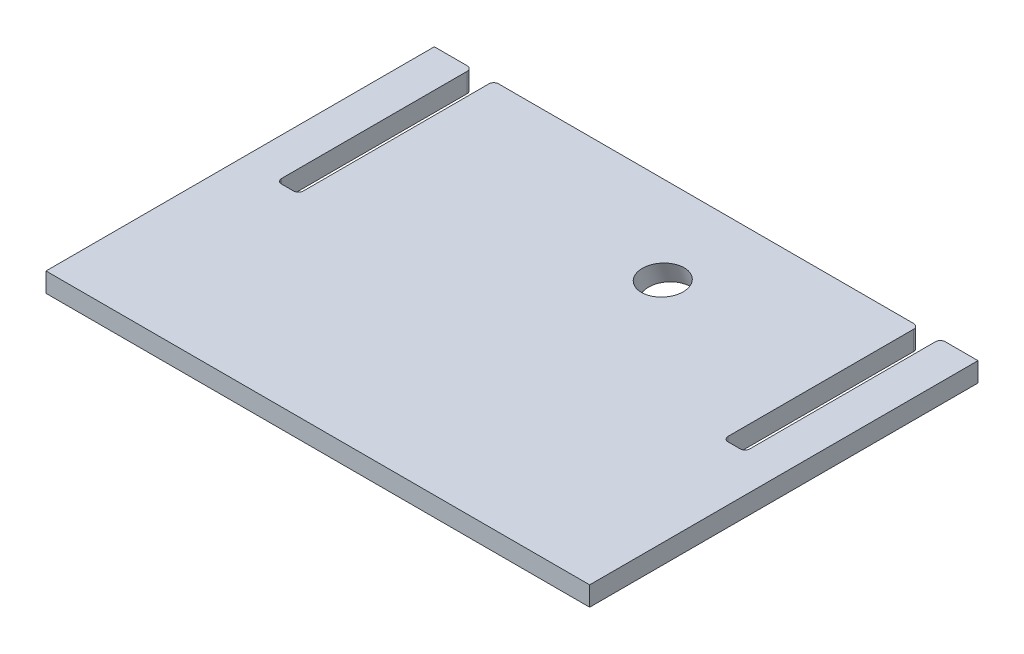
ISO-10303-21;
HEADER;
FILE_DESCRIPTION(('STEP AP214'),'2;1');
FILE_NAME('part.step','',(''),(''),'','','');
FILE_SCHEMA(('AUTOMOTIVE_DESIGN { 1 0 10303 214 1 1 1 1 }'));
ENDSEC;
DATA;
#1=APPLICATION_CONTEXT('core data for automotive mechanical design processes');
#2=APPLICATION_PROTOCOL_DEFINITION('international standard','automotive_design',2000,#1);
#3=PRODUCT_CONTEXT('',#1,'mechanical');
#4=PRODUCT('Part','Part','',(#3));
#5=PRODUCT_RELATED_PRODUCT_CATEGORY('part','',(#4));
#6=PRODUCT_DEFINITION_FORMATION('','',#4);
#7=PRODUCT_DEFINITION_CONTEXT('part definition',#1,'design');
#8=PRODUCT_DEFINITION('design','',#6,#7);
#9=PRODUCT_DEFINITION_SHAPE('','',#8);
#10=(LENGTH_UNIT() NAMED_UNIT(*) SI_UNIT(.MILLI.,.METRE.));
#11=(NAMED_UNIT(*) PLANE_ANGLE_UNIT() SI_UNIT($,.RADIAN.));
#12=(NAMED_UNIT(*) SI_UNIT($,.STERADIAN.) SOLID_ANGLE_UNIT());
#13=UNCERTAINTY_MEASURE_WITH_UNIT(LENGTH_MEASURE(1.E-05),#10,'distance_accuracy_value','');
#14=(GEOMETRIC_REPRESENTATION_CONTEXT(3) GLOBAL_UNCERTAINTY_ASSIGNED_CONTEXT((#13)) GLOBAL_UNIT_ASSIGNED_CONTEXT((#10,
#11,#12)) REPRESENTATION_CONTEXT('',''));
#15=CARTESIAN_POINT('',(0.,0.,0.));
#16=DIRECTION('',(0.,0.,1.));
#17=DIRECTION('',(1.,0.,0.));
#18=AXIS2_PLACEMENT_3D('',#15,#16,#17);
#19=CARTESIAN_POINT('',(-177.8,6.35,-127.));
#20=DIRECTION('',(0.,0.,1.));
#21=DIRECTION('',(1.,0.,0.));
#22=AXIS2_PLACEMENT_3D('',#19,#20,#21);
#23=PLANE('',#22);
#24=DIRECTION('',(-1.,0.,0.));
#25=VECTOR('',#24,1.);
#26=CARTESIAN_POINT('',(-177.8,6.35,-127.));
#27=LINE('',#26,#25);
#28=CARTESIAN_POINT('',(-156.337,6.35,-127.));
#29=VERTEX_POINT('',#28);
#30=CARTESIAN_POINT('',(-177.8,6.35,-127.));
#31=VERTEX_POINT('',#30);
#32=EDGE_CURVE('E231',#29,#31,#27,.T.);
#33=ORIENTED_EDGE('',*,*,#32,.F.);
#34=DIRECTION('',(0.,1.,0.));
#35=VECTOR('',#34,1.);
#36=CARTESIAN_POINT('',(-156.337,6.35,-127.));
#37=LINE('',#36,#35);
#38=CARTESIAN_POINT('',(-156.337,-6.35,-127.));
#39=VERTEX_POINT('',#38);
#40=EDGE_CURVE('E359',#29,#39,#37,.F.);
#41=ORIENTED_EDGE('',*,*,#40,.T.);
#42=DIRECTION('',(-1.,0.,0.));
#43=VECTOR('',#42,1.);
#44=CARTESIAN_POINT('',(-177.8,-6.35,-127.));
#45=LINE('',#44,#43);
#46=CARTESIAN_POINT('',(-177.8,-6.35,-127.));
#47=VERTEX_POINT('',#46);
#48=EDGE_CURVE('E221',#39,#47,#45,.T.);
#49=ORIENTED_EDGE('',*,*,#48,.T.);
#50=DIRECTION('',(0.,-1.,0.));
#51=VECTOR('',#50,1.);
#52=CARTESIAN_POINT('',(-177.8,6.35,-127.));
#53=LINE('',#52,#51);
#54=EDGE_CURVE('E200',#31,#47,#53,.T.);
#55=ORIENTED_EDGE('',*,*,#54,.F.);
#56=EDGE_LOOP('',(#33,#41,#49,#55));
#57=FACE_BOUND('',#56,.T.);
#58=ADVANCED_FACE('F47',(#57),#23,.F.);
#59=CARTESIAN_POINT('',(135.763,6.35,-127.));
#60=VERTEX_POINT('',#59);
#61=CARTESIAN_POINT('',(-135.763,6.35,-127.));
#62=VERTEX_POINT('',#61);
#63=EDGE_CURVE('E236',#60,#62,#27,.T.);
#64=ORIENTED_EDGE('',*,*,#63,.F.);
#65=DIRECTION('',(0.,1.,0.));
#66=VECTOR('',#65,1.);
#67=CARTESIAN_POINT('',(135.763,6.35,-127.));
#68=LINE('',#67,#66);
#69=CARTESIAN_POINT('',(135.763,-6.35,-127.));
#70=VERTEX_POINT('',#69);
#71=EDGE_CURVE('E335',#60,#70,#68,.F.);
#72=ORIENTED_EDGE('',*,*,#71,.T.);
#73=CARTESIAN_POINT('',(-135.763,-6.35,-127.));
#74=VERTEX_POINT('',#73);
#75=EDGE_CURVE('E217',#70,#74,#45,.T.);
#76=ORIENTED_EDGE('',*,*,#75,.T.);
#77=DIRECTION('',(0.,1.,0.));
#78=VECTOR('',#77,1.);
#79=CARTESIAN_POINT('',(-135.763,6.35,-127.));
#80=LINE('',#79,#78);
#81=EDGE_CURVE('E331',#74,#62,#80,.T.);
#82=ORIENTED_EDGE('',*,*,#81,.T.);
#83=EDGE_LOOP('',(#64,#72,#76,#82));
#84=FACE_BOUND('',#83,.T.);
#85=ADVANCED_FACE('F445',(#84),#23,.F.);
#86=CARTESIAN_POINT('',(177.8,6.35,-127.));
#87=DIRECTION('',(-1.,0.,0.));
#88=DIRECTION('',(0.,0.,1.));
#89=AXIS2_PLACEMENT_3D('',#86,#87,#88);
#90=PLANE('',#89);
#91=DIRECTION('',(0.,0.,-1.));
#92=VECTOR('',#91,1.);
#93=CARTESIAN_POINT('',(177.8,-6.35,-127.));
#94=LINE('',#93,#92);
#95=CARTESIAN_POINT('',(177.8,-6.35,127.));
#96=VERTEX_POINT('',#95);
#97=CARTESIAN_POINT('',(177.8,-6.35,-127.));
#98=VERTEX_POINT('',#97);
#99=EDGE_CURVE('E206',#96,#98,#94,.T.);
#100=ORIENTED_EDGE('',*,*,#99,.T.);
#101=DIRECTION('',(0.,-1.,0.));
#102=VECTOR('',#101,1.);
#103=CARTESIAN_POINT('',(177.8,6.35,-127.));
#104=LINE('',#103,#102);
#105=CARTESIAN_POINT('',(177.8,6.35,-127.));
#106=VERTEX_POINT('',#105);
#107=EDGE_CURVE('E392',#106,#98,#104,.T.);
#108=ORIENTED_EDGE('',*,*,#107,.F.);
#109=DIRECTION('',(0.,0.,-1.));
#110=VECTOR('',#109,1.);
#111=CARTESIAN_POINT('',(177.8,6.35,-127.));
#112=LINE('',#111,#110);
#113=CARTESIAN_POINT('',(177.8,6.35,127.));
#114=VERTEX_POINT('',#113);
#115=EDGE_CURVE('E208',#114,#106,#112,.T.);
#116=ORIENTED_EDGE('',*,*,#115,.F.);
#117=DIRECTION('',(0.,-1.,0.));
#118=VECTOR('',#117,1.);
#119=CARTESIAN_POINT('',(177.8,6.35,127.));
#120=LINE('',#119,#118);
#121=EDGE_CURVE('E193',#114,#96,#120,.T.);
#122=ORIENTED_EDGE('',*,*,#121,.T.);
#123=EDGE_LOOP('',(#100,#108,#116,#122));
#124=FACE_BOUND('',#123,.T.);
#125=ADVANCED_FACE('F204',(#124),#90,.F.);
#126=CARTESIAN_POINT('',(156.337,-6.35,-127.));
#127=VERTEX_POINT('',#126);
#128=EDGE_CURVE('E210',#98,#127,#45,.T.);
#129=ORIENTED_EDGE('',*,*,#128,.T.);
#130=DIRECTION('',(0.,1.,0.));
#131=VECTOR('',#130,1.);
#132=CARTESIAN_POINT('',(156.337,6.35,-127.));
#133=LINE('',#132,#131);
#134=CARTESIAN_POINT('',(156.337,6.35,-127.));
#135=VERTEX_POINT('',#134);
#136=EDGE_CURVE('E283',#127,#135,#133,.T.);
#137=ORIENTED_EDGE('',*,*,#136,.T.);
#138=EDGE_CURVE('E232',#106,#135,#27,.T.);
#139=ORIENTED_EDGE('',*,*,#138,.F.);
#140=ORIENTED_EDGE('',*,*,#107,.T.);
#141=EDGE_LOOP('',(#129,#137,#139,#140));
#142=FACE_BOUND('',#141,.T.);
#143=ADVANCED_FACE('F473',(#142),#23,.F.);
#144=CARTESIAN_POINT('',(-177.8,6.35,-127.));
#145=DIRECTION('',(1.,0.,0.));
#146=DIRECTION('',(0.,0.,-1.));
#147=AXIS2_PLACEMENT_3D('',#144,#145,#146);
#148=PLANE('',#147);
#149=DIRECTION('',(0.,0.,1.));
#150=VECTOR('',#149,1.);
#151=CARTESIAN_POINT('',(-177.8,-6.35,-127.));
#152=LINE('',#151,#150);
#153=CARTESIAN_POINT('',(-177.8,-6.35,127.));
#154=VERTEX_POINT('',#153);
#155=EDGE_CURVE('E390',#47,#154,#152,.T.);
#156=ORIENTED_EDGE('',*,*,#155,.T.);
#157=DIRECTION('',(0.,-1.,0.));
#158=VECTOR('',#157,1.);
#159=CARTESIAN_POINT('',(-177.8,6.35,127.));
#160=LINE('',#159,#158);
#161=CARTESIAN_POINT('',(-177.8,6.35,127.));
#162=VERTEX_POINT('',#161);
#163=EDGE_CURVE('E196',#162,#154,#160,.T.);
#164=ORIENTED_EDGE('',*,*,#163,.F.);
#165=DIRECTION('',(0.,0.,1.));
#166=VECTOR('',#165,1.);
#167=CARTESIAN_POINT('',(-177.8,6.35,-127.));
#168=LINE('',#167,#166);
#169=EDGE_CURVE('E228',#31,#162,#168,.T.);
#170=ORIENTED_EDGE('',*,*,#169,.F.);
#171=ORIENTED_EDGE('',*,*,#54,.T.);
#172=EDGE_LOOP('',(#156,#164,#170,#171));
#173=FACE_BOUND('',#172,.T.);
#174=ADVANCED_FACE('F408',(#173),#148,.F.);
#175=CARTESIAN_POINT('',(-177.8,6.35,127.));
#176=DIRECTION('',(0.,0.,-1.));
#177=DIRECTION('',(-1.,0.,0.));
#178=AXIS2_PLACEMENT_3D('',#175,#176,#177);
#179=PLANE('',#178);
#180=DIRECTION('',(1.,0.,0.));
#181=VECTOR('',#180,1.);
#182=CARTESIAN_POINT('',(-177.8,-6.35,127.));
#183=LINE('',#182,#181);
#184=EDGE_CURVE('E189',#154,#96,#183,.T.);
#185=ORIENTED_EDGE('',*,*,#184,.T.);
#186=ORIENTED_EDGE('',*,*,#121,.F.);
#187=DIRECTION('',(1.,0.,0.));
#188=VECTOR('',#187,1.);
#189=CARTESIAN_POINT('',(-177.8,6.35,127.));
#190=LINE('',#189,#188);
#191=EDGE_CURVE('E225',#162,#114,#190,.T.);
#192=ORIENTED_EDGE('',*,*,#191,.F.);
#193=ORIENTED_EDGE('',*,*,#163,.T.);
#194=EDGE_LOOP('',(#185,#186,#192,#193));
#195=FACE_BOUND('',#194,.T.);
#196=ADVANCED_FACE('F191',(#195),#179,.F.);
#197=CARTESIAN_POINT('',(0.,6.35,0.));
#198=DIRECTION('',(0.,1.,0.));
#199=DIRECTION('',(0.,0.,1.));
#200=AXIS2_PLACEMENT_3D('',#197,#198,#199);
#201=PLANE('',#200);
#202=CARTESIAN_POINT('',(29.06326332179,6.35,-69.5494140717771));
#203=DIRECTION('',(0.,1.,0.));
#204=DIRECTION('',(0.,0.,1.));
#205=AXIS2_PLACEMENT_3D('',#202,#203,#204);
#206=ELLIPSE('',#205,13.9966885153252,13.335);
#207=CARTESIAN_POINT('',(29.0632633217901,6.35,-55.5527255564518));
#208=VERTEX_POINT('',#207);
#209=EDGE_CURVE('E380',#208,#208,#206,.F.);
#210=ORIENTED_EDGE('',*,*,#209,.T.);
#211=EDGE_LOOP('',(#210));
#212=FACE_BOUND('',#211,.T.);
#213=ORIENTED_EDGE('',*,*,#138,.T.);
#214=CARTESIAN_POINT('',(156.337,6.35,-123.825));
#215=DIRECTION('',(0.,1.,0.));
#216=DIRECTION('',(0.,0.,1.));
#217=AXIS2_PLACEMENT_3D('',#214,#215,#216);
#218=CIRCLE('',#217,3.175);
#219=CARTESIAN_POINT('',(153.162,6.35,-123.825));
#220=VERTEX_POINT('',#219);
#221=EDGE_CURVE('E296',#135,#220,#218,.T.);
#222=ORIENTED_EDGE('',*,*,#221,.T.);
#223=DIRECTION('',(0.,0.,-1.));
#224=VECTOR('',#223,1.);
#225=CARTESIAN_POINT('',(153.162,6.35,0.));
#226=LINE('',#225,#224);
#227=CARTESIAN_POINT('',(153.162,6.35,-2.413));
#228=VERTEX_POINT('',#227);
#229=EDGE_CURVE('E267',#228,#220,#226,.T.);
#230=ORIENTED_EDGE('',*,*,#229,.F.);
#231=CARTESIAN_POINT('',(149.987,6.35,-2.413));
#232=DIRECTION('',(0.,1.,0.));
#233=DIRECTION('',(0.,0.,1.));
#234=AXIS2_PLACEMENT_3D('',#231,#232,#233);
#235=CIRCLE('',#234,3.175);
#236=CARTESIAN_POINT('',(149.987,6.35,0.762));
#237=VERTEX_POINT('',#236);
#238=EDGE_CURVE('E362',#228,#237,#235,.F.);
#239=ORIENTED_EDGE('',*,*,#238,.T.);
#240=DIRECTION('',(1.,0.,0.));
#241=VECTOR('',#240,1.);
#242=CARTESIAN_POINT('',(0.,6.35,0.762));
#243=LINE('',#242,#241);
#244=CARTESIAN_POINT('',(142.113,6.35,0.762));
#245=VERTEX_POINT('',#244);
#246=EDGE_CURVE('E244',#245,#237,#243,.T.);
#247=ORIENTED_EDGE('',*,*,#246,.F.);
#248=CARTESIAN_POINT('',(142.113,6.35,-2.413));
#249=DIRECTION('',(0.,1.,0.));
#250=DIRECTION('',(0.,0.,1.));
#251=AXIS2_PLACEMENT_3D('',#248,#249,#250);
#252=CIRCLE('',#251,3.175);
#253=CARTESIAN_POINT('',(138.938,6.35,-2.413));
#254=VERTEX_POINT('',#253);
#255=EDGE_CURVE('E368',#245,#254,#252,.F.);
#256=ORIENTED_EDGE('',*,*,#255,.T.);
#257=DIRECTION('',(0.,0.,1.));
#258=VECTOR('',#257,1.);
#259=CARTESIAN_POINT('',(138.938,6.35,0.));
#260=LINE('',#259,#258);
#261=CARTESIAN_POINT('',(138.938,6.35,-123.825));
#262=VERTEX_POINT('',#261);
#263=EDGE_CURVE('E268',#262,#254,#260,.T.);
#264=ORIENTED_EDGE('',*,*,#263,.F.);
#265=CARTESIAN_POINT('',(135.763,6.35,-123.825));
#266=DIRECTION('',(0.,1.,0.));
#267=DIRECTION('',(0.,0.,1.));
#268=AXIS2_PLACEMENT_3D('',#265,#266,#267);
#269=CIRCLE('',#268,3.175);
#270=EDGE_CURVE('E293',#262,#60,#269,.T.);
#271=ORIENTED_EDGE('',*,*,#270,.T.);
#272=ORIENTED_EDGE('',*,*,#63,.T.);
#273=CARTESIAN_POINT('',(-135.763,6.35,-123.825));
#274=DIRECTION('',(0.,1.,0.));
#275=DIRECTION('',(0.,0.,1.));
#276=AXIS2_PLACEMENT_3D('',#273,#274,#275);
#277=CIRCLE('',#276,3.175);
#278=CARTESIAN_POINT('',(-138.938,6.35,-123.825));
#279=VERTEX_POINT('',#278);
#280=EDGE_CURVE('E290',#62,#279,#277,.T.);
#281=ORIENTED_EDGE('',*,*,#280,.T.);
#282=DIRECTION('',(0.,0.,-1.));
#283=VECTOR('',#282,1.);
#284=CARTESIAN_POINT('',(-138.938,6.35,0.));
#285=LINE('',#284,#283);
#286=CARTESIAN_POINT('',(-138.938,6.35,-2.41300000000005));
#287=VERTEX_POINT('',#286);
#288=EDGE_CURVE('E243',#287,#279,#285,.T.);
#289=ORIENTED_EDGE('',*,*,#288,.F.);
#290=CARTESIAN_POINT('',(-142.113,6.35,-2.41300000000005));
#291=DIRECTION('',(0.,1.,0.));
#292=DIRECTION('',(0.,0.,1.));
#293=AXIS2_PLACEMENT_3D('',#290,#291,#292);
#294=CIRCLE('',#293,3.175);
#295=CARTESIAN_POINT('',(-142.113,6.35,0.761999999999944));
#296=VERTEX_POINT('',#295);
#297=EDGE_CURVE('E373',#287,#296,#294,.F.);
#298=ORIENTED_EDGE('',*,*,#297,.T.);
#299=DIRECTION('',(1.,0.,0.));
#300=VECTOR('',#299,1.);
#301=CARTESIAN_POINT('',(0.,6.35,0.761999999999944));
#302=LINE('',#301,#300);
#303=CARTESIAN_POINT('',(-149.987,6.35,0.761999999999944));
#304=VERTEX_POINT('',#303);
#305=EDGE_CURVE('E261',#304,#296,#302,.T.);
#306=ORIENTED_EDGE('',*,*,#305,.F.);
#307=CARTESIAN_POINT('',(-149.987,6.35,-2.41300000000006));
#308=DIRECTION('',(0.,1.,0.));
#309=DIRECTION('',(0.,0.,1.));
#310=AXIS2_PLACEMENT_3D('',#307,#308,#309);
#311=CIRCLE('',#310,3.175);
#312=CARTESIAN_POINT('',(-153.162,6.35,-2.41300000000005));
#313=VERTEX_POINT('',#312);
#314=EDGE_CURVE('E57',#304,#313,#311,.F.);
#315=ORIENTED_EDGE('',*,*,#314,.T.);
#316=DIRECTION('',(0.,0.,1.));
#317=VECTOR('',#316,1.);
#318=CARTESIAN_POINT('',(-153.162,6.35,0.));
#319=LINE('',#318,#317);
#320=CARTESIAN_POINT('',(-153.162,6.35,-123.825));
#321=VERTEX_POINT('',#320);
#322=EDGE_CURVE('E239',#321,#313,#319,.T.);
#323=ORIENTED_EDGE('',*,*,#322,.F.);
#324=CARTESIAN_POINT('',(-156.337,6.35,-123.825));
#325=DIRECTION('',(0.,1.,0.));
#326=DIRECTION('',(0.,0.,1.));
#327=AXIS2_PLACEMENT_3D('',#324,#325,#326);
#328=CIRCLE('',#327,3.175);
#329=EDGE_CURVE('E287',#321,#29,#328,.T.);
#330=ORIENTED_EDGE('',*,*,#329,.T.);
#331=ORIENTED_EDGE('',*,*,#32,.T.);
#332=ORIENTED_EDGE('',*,*,#169,.T.);
#333=ORIENTED_EDGE('',*,*,#191,.T.);
#334=ORIENTED_EDGE('',*,*,#115,.T.);
#335=EDGE_LOOP('',(#213,#222,#230,#239,#247,#256,#264,#271,#272,#281,#289,#298,#306,#315,#323,
#330,#331,#332,#333,#334));
#336=FACE_BOUND('',#335,.T.);
#337=ADVANCED_FACE('F410',(#212,#336),#201,.T.);
#338=CARTESIAN_POINT('',(0.,-6.35,0.));
#339=DIRECTION('',(0.,1.,0.));
#340=DIRECTION('',(0.,0.,1.));
#341=AXIS2_PLACEMENT_3D('',#338,#339,#340);
#342=PLANE('',#341);
#343=CARTESIAN_POINT('',(29.06326332179,-6.35,-73.599560553833));
#344=DIRECTION('',(0.,1.,0.));
#345=DIRECTION('',(0.,0.,1.));
#346=AXIS2_PLACEMENT_3D('',#343,#344,#345);
#347=ELLIPSE('',#346,13.9966885153252,13.335);
#348=CARTESIAN_POINT('',(29.0632633217901,-6.35,-59.6028720385078));
#349=VERTEX_POINT('',#348);
#350=EDGE_CURVE('E51',#349,#349,#347,.F.);
#351=ORIENTED_EDGE('',*,*,#350,.F.);
#352=EDGE_LOOP('',(#351));
#353=FACE_BOUND('',#352,.T.);
#354=DIRECTION('',(0.,0.,-1.));
#355=VECTOR('',#354,1.);
#356=CARTESIAN_POINT('',(153.162,-6.35,0.));
#357=LINE('',#356,#355);
#358=CARTESIAN_POINT('',(153.162,-6.35,-2.413));
#359=VERTEX_POINT('',#358);
#360=CARTESIAN_POINT('',(153.162,-6.35,-123.825));
#361=VERTEX_POINT('',#360);
#362=EDGE_CURVE('E272',#359,#361,#357,.T.);
#363=ORIENTED_EDGE('',*,*,#362,.T.);
#364=CARTESIAN_POINT('',(156.337,-6.35,-123.825));
#365=DIRECTION('',(0.,1.,0.));
#366=DIRECTION('',(0.,0.,1.));
#367=AXIS2_PLACEMENT_3D('',#364,#365,#366);
#368=CIRCLE('',#367,3.175);
#369=EDGE_CURVE('E315',#361,#127,#368,.F.);
#370=ORIENTED_EDGE('',*,*,#369,.T.);
#371=ORIENTED_EDGE('',*,*,#128,.F.);
#372=ORIENTED_EDGE('',*,*,#99,.F.);
#373=ORIENTED_EDGE('',*,*,#184,.F.);
#374=ORIENTED_EDGE('',*,*,#155,.F.);
#375=ORIENTED_EDGE('',*,*,#48,.F.);
#376=CARTESIAN_POINT('',(-156.337,-6.35,-123.825));
#377=DIRECTION('',(0.,1.,0.));
#378=DIRECTION('',(0.,0.,1.));
#379=AXIS2_PLACEMENT_3D('',#376,#377,#378);
#380=CIRCLE('',#379,3.175);
#381=CARTESIAN_POINT('',(-153.162,-6.35,-123.825));
#382=VERTEX_POINT('',#381);
#383=EDGE_CURVE('E306',#39,#382,#380,.F.);
#384=ORIENTED_EDGE('',*,*,#383,.T.);
#385=DIRECTION('',(0.,0.,1.));
#386=VECTOR('',#385,1.);
#387=CARTESIAN_POINT('',(-153.162,-6.35,0.));
#388=LINE('',#387,#386);
#389=CARTESIAN_POINT('',(-153.162,-6.35,-2.41300000000005));
#390=VERTEX_POINT('',#389);
#391=EDGE_CURVE('E245',#382,#390,#388,.T.);
#392=ORIENTED_EDGE('',*,*,#391,.T.);
#393=CARTESIAN_POINT('',(-149.987,-6.35,-2.41300000000006));
#394=DIRECTION('',(0.,1.,0.));
#395=DIRECTION('',(0.,0.,1.));
#396=AXIS2_PLACEMENT_3D('',#393,#394,#395);
#397=CIRCLE('',#396,3.175);
#398=CARTESIAN_POINT('',(-149.987,-6.35,0.761999999999944));
#399=VERTEX_POINT('',#398);
#400=EDGE_CURVE('E12',#390,#399,#397,.T.);
#401=ORIENTED_EDGE('',*,*,#400,.T.);
#402=DIRECTION('',(1.,0.,0.));
#403=VECTOR('',#402,1.);
#404=CARTESIAN_POINT('',(0.,-6.35,0.761999999999944));
#405=LINE('',#404,#403);
#406=CARTESIAN_POINT('',(-142.113,-6.35,0.761999999999944));
#407=VERTEX_POINT('',#406);
#408=EDGE_CURVE('E249',#399,#407,#405,.T.);
#409=ORIENTED_EDGE('',*,*,#408,.T.);
#410=CARTESIAN_POINT('',(-142.113,-6.35,-2.41300000000005));
#411=DIRECTION('',(0.,1.,0.));
#412=DIRECTION('',(0.,0.,1.));
#413=AXIS2_PLACEMENT_3D('',#410,#411,#412);
#414=CIRCLE('',#413,3.175);
#415=CARTESIAN_POINT('',(-138.938,-6.35,-2.41300000000005));
#416=VERTEX_POINT('',#415);
#417=EDGE_CURVE('E376',#407,#416,#414,.T.);
#418=ORIENTED_EDGE('',*,*,#417,.T.);
#419=DIRECTION('',(0.,0.,-1.));
#420=VECTOR('',#419,1.);
#421=CARTESIAN_POINT('',(-138.938,-6.35,0.));
#422=LINE('',#421,#420);
#423=CARTESIAN_POINT('',(-138.938,-6.35,-123.825));
#424=VERTEX_POINT('',#423);
#425=EDGE_CURVE('E253',#416,#424,#422,.T.);
#426=ORIENTED_EDGE('',*,*,#425,.T.);
#427=CARTESIAN_POINT('',(-135.763,-6.35,-123.825));
#428=DIRECTION('',(0.,1.,0.));
#429=DIRECTION('',(0.,0.,1.));
#430=AXIS2_PLACEMENT_3D('',#427,#428,#429);
#431=CIRCLE('',#430,3.175);
#432=EDGE_CURVE('E309',#424,#74,#431,.F.);
#433=ORIENTED_EDGE('',*,*,#432,.T.);
#434=ORIENTED_EDGE('',*,*,#75,.F.);
#435=CARTESIAN_POINT('',(135.763,-6.35,-123.825));
#436=DIRECTION('',(0.,1.,0.));
#437=DIRECTION('',(0.,0.,1.));
#438=AXIS2_PLACEMENT_3D('',#435,#436,#437);
#439=CIRCLE('',#438,3.175);
#440=CARTESIAN_POINT('',(138.938,-6.35,-123.825));
#441=VERTEX_POINT('',#440);
#442=EDGE_CURVE('E312',#70,#441,#439,.F.);
#443=ORIENTED_EDGE('',*,*,#442,.T.);
#444=DIRECTION('',(0.,0.,1.));
#445=VECTOR('',#444,1.);
#446=CARTESIAN_POINT('',(138.938,-6.35,0.));
#447=LINE('',#446,#445);
#448=CARTESIAN_POINT('',(138.938,-6.35,-2.413));
#449=VERTEX_POINT('',#448);
#450=EDGE_CURVE('E257',#441,#449,#447,.T.);
#451=ORIENTED_EDGE('',*,*,#450,.T.);
#452=CARTESIAN_POINT('',(142.113,-6.35,-2.413));
#453=DIRECTION('',(0.,1.,0.));
#454=DIRECTION('',(0.,0.,1.));
#455=AXIS2_PLACEMENT_3D('',#452,#453,#454);
#456=CIRCLE('',#455,3.175);
#457=CARTESIAN_POINT('',(142.113,-6.35,0.762));
#458=VERTEX_POINT('',#457);
#459=EDGE_CURVE('E72',#449,#458,#456,.T.);
#460=ORIENTED_EDGE('',*,*,#459,.T.);
#461=DIRECTION('',(1.,0.,0.));
#462=VECTOR('',#461,1.);
#463=CARTESIAN_POINT('',(0.,-6.35,0.762));
#464=LINE('',#463,#462);
#465=CARTESIAN_POINT('',(149.987,-6.35,0.762));
#466=VERTEX_POINT('',#465);
#467=EDGE_CURVE('E275',#458,#466,#464,.T.);
#468=ORIENTED_EDGE('',*,*,#467,.T.);
#469=CARTESIAN_POINT('',(149.987,-6.35,-2.413));
#470=DIRECTION('',(0.,1.,0.));
#471=DIRECTION('',(0.,0.,1.));
#472=AXIS2_PLACEMENT_3D('',#469,#470,#471);
#473=CIRCLE('',#472,3.175);
#474=EDGE_CURVE('E365',#466,#359,#473,.T.);
#475=ORIENTED_EDGE('',*,*,#474,.T.);
#476=EDGE_LOOP('',(#363,#370,#371,#372,#373,#374,#375,#384,#392,#401,#409,#418,#426,#433,#434,
#443,#451,#460,#468,#475));
#477=FACE_BOUND('',#476,.T.);
#478=ADVANCED_FACE('F213',(#353,#477),#342,.F.);
#479=CARTESIAN_POINT('',(138.938,-6.35,-127.));
#480=DIRECTION('',(-1.,0.,0.));
#481=DIRECTION('',(0.,0.,1.));
#482=AXIS2_PLACEMENT_3D('',#479,#480,#481);
#483=PLANE('',#482);
#484=ORIENTED_EDGE('',*,*,#263,.T.);
#485=DIRECTION('',(0.,1.,0.));
#486=VECTOR('',#485,1.);
#487=CARTESIAN_POINT('',(138.938,-6.35,-2.413));
#488=LINE('',#487,#486);
#489=EDGE_CURVE('E328',#254,#449,#488,.F.);
#490=ORIENTED_EDGE('',*,*,#489,.T.);
#491=ORIENTED_EDGE('',*,*,#450,.F.);
#492=DIRECTION('',(0.,1.,0.));
#493=VECTOR('',#492,1.);
#494=CARTESIAN_POINT('',(138.938,-6.35,-123.825));
#495=LINE('',#494,#493);
#496=EDGE_CURVE('E324',#441,#262,#495,.T.);
#497=ORIENTED_EDGE('',*,*,#496,.T.);
#498=EDGE_LOOP('',(#484,#490,#491,#497));
#499=FACE_BOUND('',#498,.T.);
#500=ADVANCED_FACE('F453',(#499),#483,.F.);
#501=CARTESIAN_POINT('',(153.162,-6.35,-127.));
#502=DIRECTION('',(1.,0.,0.));
#503=DIRECTION('',(0.,0.,-1.));
#504=AXIS2_PLACEMENT_3D('',#501,#502,#503);
#505=PLANE('',#504);
#506=ORIENTED_EDGE('',*,*,#229,.T.);
#507=DIRECTION('',(0.,1.,0.));
#508=VECTOR('',#507,1.);
#509=CARTESIAN_POINT('',(153.162,-6.35,-123.825));
#510=LINE('',#509,#508);
#511=EDGE_CURVE('E303',#220,#361,#510,.F.);
#512=ORIENTED_EDGE('',*,*,#511,.T.);
#513=ORIENTED_EDGE('',*,*,#362,.F.);
#514=DIRECTION('',(0.,1.,0.));
#515=VECTOR('',#514,1.);
#516=CARTESIAN_POINT('',(153.162,6.35,-2.413));
#517=LINE('',#516,#515);
#518=EDGE_CURVE('E299',#359,#228,#517,.T.);
#519=ORIENTED_EDGE('',*,*,#518,.T.);
#520=EDGE_LOOP('',(#506,#512,#513,#519));
#521=FACE_BOUND('',#520,.T.);
#522=ADVANCED_FACE('F468',(#521),#505,.F.);
#523=CARTESIAN_POINT('',(139.7,-6.35,0.762));
#524=DIRECTION('',(0.,0.,1.));
#525=DIRECTION('',(1.,0.,0.));
#526=AXIS2_PLACEMENT_3D('',#523,#524,#525);
#527=PLANE('',#526);
#528=ORIENTED_EDGE('',*,*,#246,.T.);
#529=DIRECTION('',(0.,1.,0.));
#530=VECTOR('',#529,1.);
#531=CARTESIAN_POINT('',(149.987,-6.35,0.762));
#532=LINE('',#531,#530);
#533=EDGE_CURVE('E65',#237,#466,#532,.F.);
#534=ORIENTED_EDGE('',*,*,#533,.T.);
#535=ORIENTED_EDGE('',*,*,#467,.F.);
#536=DIRECTION('',(0.,1.,0.));
#537=VECTOR('',#536,1.);
#538=CARTESIAN_POINT('',(142.113,6.35,0.762));
#539=LINE('',#538,#537);
#540=EDGE_CURVE('E318',#458,#245,#539,.T.);
#541=ORIENTED_EDGE('',*,*,#540,.T.);
#542=EDGE_LOOP('',(#528,#534,#535,#541));
#543=FACE_BOUND('',#542,.T.);
#544=ADVANCED_FACE('F460',(#543),#527,.F.);
#545=CARTESIAN_POINT('',(-153.162,-6.35,-127.));
#546=DIRECTION('',(-1.,0.,0.));
#547=DIRECTION('',(0.,0.,1.));
#548=AXIS2_PLACEMENT_3D('',#545,#546,#547);
#549=PLANE('',#548);
#550=ORIENTED_EDGE('',*,*,#391,.F.);
#551=DIRECTION('',(0.,1.,0.));
#552=VECTOR('',#551,1.);
#553=CARTESIAN_POINT('',(-153.162,-6.35,-123.825));
#554=LINE('',#553,#552);
#555=EDGE_CURVE('E355',#382,#321,#554,.T.);
#556=ORIENTED_EDGE('',*,*,#555,.T.);
#557=ORIENTED_EDGE('',*,*,#322,.T.);
#558=DIRECTION('',(0.,1.,0.));
#559=VECTOR('',#558,1.);
#560=CARTESIAN_POINT('',(-153.162,-6.35,-2.41300000000005));
#561=LINE('',#560,#559);
#562=EDGE_CURVE('E352',#313,#390,#561,.F.);
#563=ORIENTED_EDGE('',*,*,#562,.T.);
#564=EDGE_LOOP('',(#550,#556,#557,#563));
#565=FACE_BOUND('',#564,.T.);
#566=ADVANCED_FACE('F418',(#565),#549,.F.);
#567=CARTESIAN_POINT('',(-138.938,-6.35,-127.));
#568=DIRECTION('',(1.,0.,0.));
#569=DIRECTION('',(0.,0.,-1.));
#570=AXIS2_PLACEMENT_3D('',#567,#568,#569);
#571=PLANE('',#570);
#572=ORIENTED_EDGE('',*,*,#288,.T.);
#573=DIRECTION('',(0.,1.,0.));
#574=VECTOR('',#573,1.);
#575=CARTESIAN_POINT('',(-138.938,-6.35,-123.825));
#576=LINE('',#575,#574);
#577=EDGE_CURVE('E342',#279,#424,#576,.F.);
#578=ORIENTED_EDGE('',*,*,#577,.T.);
#579=ORIENTED_EDGE('',*,*,#425,.F.);
#580=DIRECTION('',(0.,1.,0.));
#581=VECTOR('',#580,1.);
#582=CARTESIAN_POINT('',(-138.938,6.35,-2.41300000000005));
#583=LINE('',#582,#581);
#584=EDGE_CURVE('E338',#416,#287,#583,.T.);
#585=ORIENTED_EDGE('',*,*,#584,.T.);
#586=EDGE_LOOP('',(#572,#578,#579,#585));
#587=FACE_BOUND('',#586,.T.);
#588=ADVANCED_FACE('F435',(#587),#571,.F.);
#589=CARTESIAN_POINT('',(-152.4,-6.35,0.761999999999944));
#590=DIRECTION('',(0.,0.,1.));
#591=DIRECTION('',(1.,0.,0.));
#592=AXIS2_PLACEMENT_3D('',#589,#590,#591);
#593=PLANE('',#592);
#594=ORIENTED_EDGE('',*,*,#305,.T.);
#595=DIRECTION('',(0.,1.,0.));
#596=VECTOR('',#595,1.);
#597=CARTESIAN_POINT('',(-142.113,-6.35,0.761999999999944));
#598=LINE('',#597,#596);
#599=EDGE_CURVE('E349',#296,#407,#598,.F.);
#600=ORIENTED_EDGE('',*,*,#599,.T.);
#601=ORIENTED_EDGE('',*,*,#408,.F.);
#602=DIRECTION('',(0.,1.,0.));
#603=VECTOR('',#602,1.);
#604=CARTESIAN_POINT('',(-149.987,6.35,0.761999999999944));
#605=LINE('',#604,#603);
#606=EDGE_CURVE('E345',#399,#304,#605,.T.);
#607=ORIENTED_EDGE('',*,*,#606,.T.);
#608=EDGE_LOOP('',(#594,#600,#601,#607));
#609=FACE_BOUND('',#608,.T.);
#610=ADVANCED_FACE('F426',(#609),#593,.F.);
#611=CARTESIAN_POINT('',(29.0632633217899,-44.4499999999978,-85.7500000000002));
#612=DIRECTION('',(0.,0.95272535252887,0.303832853142546));
#613=DIRECTION('',(0.,-0.303832853142546,0.95272535252887));
#614=AXIS2_PLACEMENT_3D('',#611,#612,#613);
#615=CYLINDRICAL_SURFACE('',#614,13.335);
#616=ORIENTED_EDGE('',*,*,#209,.F.);
#617=EDGE_LOOP('',(#616));
#618=FACE_BOUND('',#617,.T.);
#619=ORIENTED_EDGE('',*,*,#350,.T.);
#620=EDGE_LOOP('',(#619));
#621=FACE_BOUND('',#620,.T.);
#622=ADVANCED_FACE('F49',(#618,#621),#615,.F.);
#623=CARTESIAN_POINT('',(156.337,6.35,-123.825));
#624=DIRECTION('',(0.,1.,0.));
#625=DIRECTION('',(0.,0.,1.));
#626=AXIS2_PLACEMENT_3D('',#623,#624,#625);
#627=CYLINDRICAL_SURFACE('',#626,3.175);
#628=ORIENTED_EDGE('',*,*,#369,.F.);
#629=ORIENTED_EDGE('',*,*,#511,.F.);
#630=ORIENTED_EDGE('',*,*,#221,.F.);
#631=ORIENTED_EDGE('',*,*,#136,.F.);
#632=EDGE_LOOP('',(#628,#629,#630,#631));
#633=FACE_BOUND('',#632,.T.);
#634=ADVANCED_FACE('F472',(#633),#627,.T.);
#635=CARTESIAN_POINT('',(149.987,-6.35,-2.413));
#636=DIRECTION('',(0.,-1.,0.));
#637=DIRECTION('',(0.,0.,-1.));
#638=AXIS2_PLACEMENT_3D('',#635,#636,#637);
#639=CYLINDRICAL_SURFACE('',#638,3.175);
#640=ORIENTED_EDGE('',*,*,#474,.F.);
#641=ORIENTED_EDGE('',*,*,#533,.F.);
#642=ORIENTED_EDGE('',*,*,#238,.F.);
#643=ORIENTED_EDGE('',*,*,#518,.F.);
#644=EDGE_LOOP('',(#640,#641,#642,#643));
#645=FACE_BOUND('',#644,.T.);
#646=ADVANCED_FACE('F465',(#645),#639,.F.);
#647=CARTESIAN_POINT('',(142.113,-6.35,-2.413));
#648=DIRECTION('',(0.,-1.,0.));
#649=DIRECTION('',(0.,0.,-1.));
#650=AXIS2_PLACEMENT_3D('',#647,#648,#649);
#651=CYLINDRICAL_SURFACE('',#650,3.175);
#652=ORIENTED_EDGE('',*,*,#459,.F.);
#653=ORIENTED_EDGE('',*,*,#489,.F.);
#654=ORIENTED_EDGE('',*,*,#255,.F.);
#655=ORIENTED_EDGE('',*,*,#540,.F.);
#656=EDGE_LOOP('',(#652,#653,#654,#655));
#657=FACE_BOUND('',#656,.T.);
#658=ADVANCED_FACE('F457',(#657),#651,.F.);
#659=CARTESIAN_POINT('',(135.763,-6.35,-123.825));
#660=DIRECTION('',(0.,1.,0.));
#661=DIRECTION('',(0.,0.,1.));
#662=AXIS2_PLACEMENT_3D('',#659,#660,#661);
#663=CYLINDRICAL_SURFACE('',#662,3.175);
#664=ORIENTED_EDGE('',*,*,#442,.F.);
#665=ORIENTED_EDGE('',*,*,#71,.F.);
#666=ORIENTED_EDGE('',*,*,#270,.F.);
#667=ORIENTED_EDGE('',*,*,#496,.F.);
#668=EDGE_LOOP('',(#664,#665,#666,#667));
#669=FACE_BOUND('',#668,.T.);
#670=ADVANCED_FACE('F449',(#669),#663,.T.);
#671=CARTESIAN_POINT('',(-135.763,6.35,-123.825));
#672=DIRECTION('',(0.,1.,0.));
#673=DIRECTION('',(0.,0.,1.));
#674=AXIS2_PLACEMENT_3D('',#671,#672,#673);
#675=CYLINDRICAL_SURFACE('',#674,3.175);
#676=ORIENTED_EDGE('',*,*,#432,.F.);
#677=ORIENTED_EDGE('',*,*,#577,.F.);
#678=ORIENTED_EDGE('',*,*,#280,.F.);
#679=ORIENTED_EDGE('',*,*,#81,.F.);
#680=EDGE_LOOP('',(#676,#677,#678,#679));
#681=FACE_BOUND('',#680,.T.);
#682=ADVANCED_FACE('F439',(#681),#675,.T.);
#683=CARTESIAN_POINT('',(-142.113,-6.35,-2.41300000000005));
#684=DIRECTION('',(0.,-1.,0.));
#685=DIRECTION('',(0.,0.,-1.));
#686=AXIS2_PLACEMENT_3D('',#683,#684,#685);
#687=CYLINDRICAL_SURFACE('',#686,3.175);
#688=ORIENTED_EDGE('',*,*,#417,.F.);
#689=ORIENTED_EDGE('',*,*,#599,.F.);
#690=ORIENTED_EDGE('',*,*,#297,.F.);
#691=ORIENTED_EDGE('',*,*,#584,.F.);
#692=EDGE_LOOP('',(#688,#689,#690,#691));
#693=FACE_BOUND('',#692,.T.);
#694=ADVANCED_FACE('F430',(#693),#687,.F.);
#695=CARTESIAN_POINT('',(-156.337,-6.35,-123.825));
#696=DIRECTION('',(0.,1.,0.));
#697=DIRECTION('',(0.,0.,1.));
#698=AXIS2_PLACEMENT_3D('',#695,#696,#697);
#699=CYLINDRICAL_SURFACE('',#698,3.175);
#700=ORIENTED_EDGE('',*,*,#383,.F.);
#701=ORIENTED_EDGE('',*,*,#40,.F.);
#702=ORIENTED_EDGE('',*,*,#329,.F.);
#703=ORIENTED_EDGE('',*,*,#555,.F.);
#704=EDGE_LOOP('',(#700,#701,#702,#703));
#705=FACE_BOUND('',#704,.T.);
#706=ADVANCED_FACE('F413',(#705),#699,.T.);
#707=CARTESIAN_POINT('',(-149.987,-6.35,-2.41300000000006));
#708=DIRECTION('',(0.,-1.,0.));
#709=DIRECTION('',(0.,0.,-1.));
#710=AXIS2_PLACEMENT_3D('',#707,#708,#709);
#711=CYLINDRICAL_SURFACE('',#710,3.175);
#712=ORIENTED_EDGE('',*,*,#400,.F.);
#713=ORIENTED_EDGE('',*,*,#562,.F.);
#714=ORIENTED_EDGE('',*,*,#314,.F.);
#715=ORIENTED_EDGE('',*,*,#606,.F.);
#716=EDGE_LOOP('',(#712,#713,#714,#715));
#717=FACE_BOUND('',#716,.T.);
#718=ADVANCED_FACE('F421',(#717),#711,.F.);
#719=CLOSED_SHELL('',(#58,#85,#125,#143,#174,#196,#337,#478,#500,#522,#544,#566,#588,#610,#622,
#634,#646,#658,#670,#682,#694,#706,#718));
#720=MANIFOLD_SOLID_BREP('B2',#719);
#721=ADVANCED_BREP_SHAPE_REPRESENTATION('',(#18,#720),#14);
#722=SHAPE_DEFINITION_REPRESENTATION(#9,#721);
ENDSEC;
END-ISO-10303-21;
